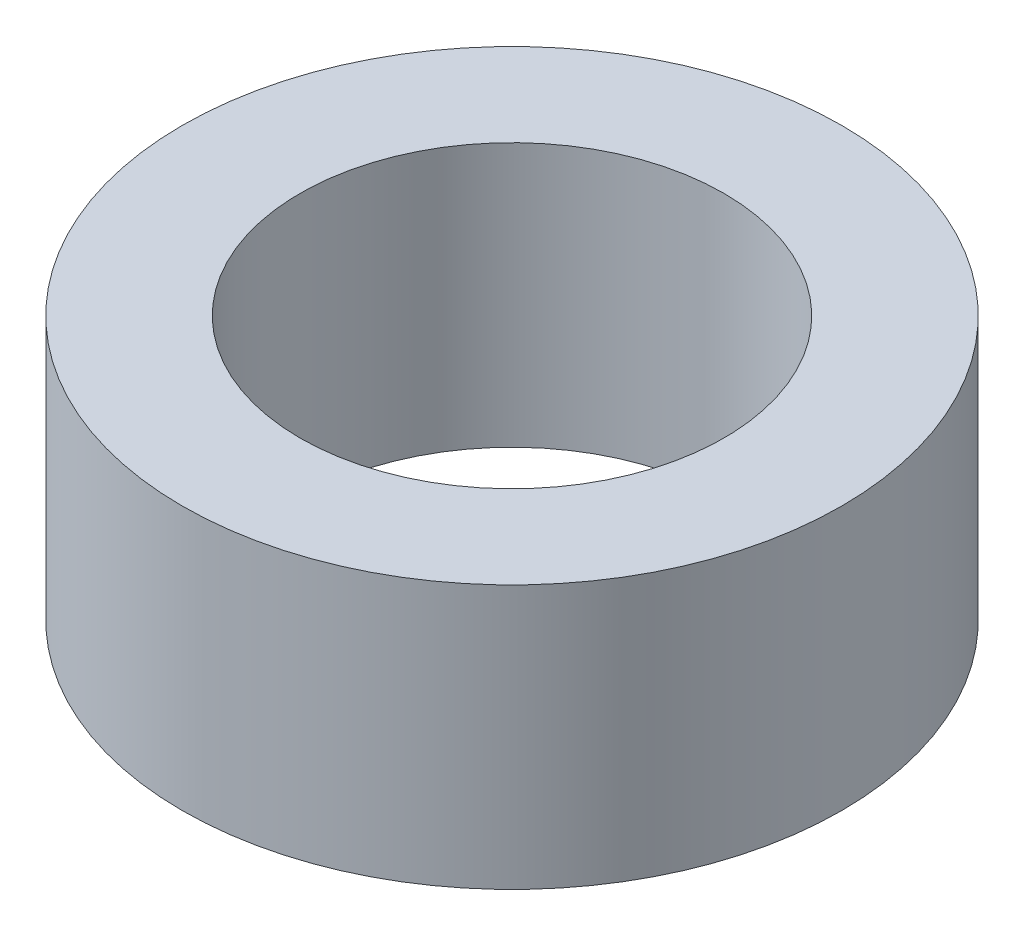
ISO-10303-21;
HEADER;
FILE_DESCRIPTION(('STEP AP214'),'2;1');
FILE_NAME('part.step','',(''),(''),'','','');
FILE_SCHEMA(('AUTOMOTIVE_DESIGN { 1 0 10303 214 1 1 1 1 }'));
ENDSEC;
DATA;
#1=APPLICATION_CONTEXT('core data for automotive mechanical design processes');
#2=APPLICATION_PROTOCOL_DEFINITION('international standard','automotive_design',2000,#1);
#3=PRODUCT_CONTEXT('',#1,'mechanical');
#4=PRODUCT('Part','Part','',(#3));
#5=PRODUCT_RELATED_PRODUCT_CATEGORY('part','',(#4));
#6=PRODUCT_DEFINITION_FORMATION('','',#4);
#7=PRODUCT_DEFINITION_CONTEXT('part definition',#1,'design');
#8=PRODUCT_DEFINITION('design','',#6,#7);
#9=PRODUCT_DEFINITION_SHAPE('','',#8);
#10=(LENGTH_UNIT() NAMED_UNIT(*) SI_UNIT(.MILLI.,.METRE.));
#11=(NAMED_UNIT(*) PLANE_ANGLE_UNIT() SI_UNIT($,.RADIAN.));
#12=(NAMED_UNIT(*) SI_UNIT($,.STERADIAN.) SOLID_ANGLE_UNIT());
#13=UNCERTAINTY_MEASURE_WITH_UNIT(LENGTH_MEASURE(1.E-05),#10,'distance_accuracy_value','');
#14=(GEOMETRIC_REPRESENTATION_CONTEXT(3) GLOBAL_UNCERTAINTY_ASSIGNED_CONTEXT((#13)) GLOBAL_UNIT_ASSIGNED_CONTEXT((#10,
#11,#12)) REPRESENTATION_CONTEXT('',''));
#15=CARTESIAN_POINT('',(0.,0.,0.));
#16=DIRECTION('',(0.,0.,1.));
#17=DIRECTION('',(1.,0.,0.));
#18=AXIS2_PLACEMENT_3D('',#15,#16,#17);
#19=CARTESIAN_POINT('',(0.,28.,0.));
#20=DIRECTION('',(0.,-1.,0.));
#21=DIRECTION('',(0.,0.,-1.));
#22=AXIS2_PLACEMENT_3D('',#19,#20,#21);
#23=CYLINDRICAL_SURFACE('',#22,35.);
#24=CARTESIAN_POINT('',(0.,28.,0.));
#25=DIRECTION('',(0.,1.,0.));
#26=DIRECTION('',(0.,0.,1.));
#27=AXIS2_PLACEMENT_3D('',#24,#25,#26);
#28=CIRCLE('',#27,35.);
#29=CARTESIAN_POINT('',(0.,28.,35.));
#30=VERTEX_POINT('',#29);
#31=EDGE_CURVE('E10',#30,#30,#28,.T.);
#32=ORIENTED_EDGE('',*,*,#31,.F.);
#33=EDGE_LOOP('',(#32));
#34=FACE_BOUND('',#33,.T.);
#35=CARTESIAN_POINT('',(0.,0.,0.));
#36=DIRECTION('',(0.,1.,0.));
#37=DIRECTION('',(0.,0.,1.));
#38=AXIS2_PLACEMENT_3D('',#35,#36,#37);
#39=CIRCLE('',#38,35.);
#40=CARTESIAN_POINT('',(0.,0.,35.));
#41=VERTEX_POINT('',#40);
#42=EDGE_CURVE('E37',#41,#41,#39,.T.);
#43=ORIENTED_EDGE('',*,*,#42,.T.);
#44=EDGE_LOOP('',(#43));
#45=FACE_BOUND('',#44,.T.);
#46=ADVANCED_FACE('F40',(#34,#45),#23,.T.);
#47=CARTESIAN_POINT('',(0.,28.,0.));
#48=DIRECTION('',(0.,1.,0.));
#49=DIRECTION('',(0.,0.,1.));
#50=AXIS2_PLACEMENT_3D('',#47,#48,#49);
#51=PLANE('',#50);
#52=CARTESIAN_POINT('',(0.,28.,0.));
#53=DIRECTION('',(0.,1.,0.));
#54=DIRECTION('',(0.,0.,1.));
#55=AXIS2_PLACEMENT_3D('',#52,#53,#54);
#56=CIRCLE('',#55,22.5);
#57=CARTESIAN_POINT('',(0.,28.,22.5));
#58=VERTEX_POINT('',#57);
#59=EDGE_CURVE('E50',#58,#58,#56,.T.);
#60=ORIENTED_EDGE('',*,*,#59,.F.);
#61=EDGE_LOOP('',(#60));
#62=FACE_BOUND('',#61,.T.);
#63=ORIENTED_EDGE('',*,*,#31,.T.);
#64=EDGE_LOOP('',(#63));
#65=FACE_BOUND('',#64,.T.);
#66=ADVANCED_FACE('F59',(#62,#65),#51,.T.);
#67=CARTESIAN_POINT('',(0.,0.,0.));
#68=DIRECTION('',(0.,1.,0.));
#69=DIRECTION('',(0.,0.,1.));
#70=AXIS2_PLACEMENT_3D('',#67,#68,#69);
#71=PLANE('',#70);
#72=CARTESIAN_POINT('',(0.,0.,0.));
#73=DIRECTION('',(0.,1.,0.));
#74=DIRECTION('',(0.,0.,1.));
#75=AXIS2_PLACEMENT_3D('',#72,#73,#74);
#76=CIRCLE('',#75,22.5);
#77=CARTESIAN_POINT('',(0.,0.,22.5));
#78=VERTEX_POINT('',#77);
#79=EDGE_CURVE('E47',#78,#78,#76,.T.);
#80=ORIENTED_EDGE('',*,*,#79,.T.);
#81=EDGE_LOOP('',(#80));
#82=FACE_BOUND('',#81,.T.);
#83=ORIENTED_EDGE('',*,*,#42,.F.);
#84=EDGE_LOOP('',(#83));
#85=FACE_BOUND('',#84,.T.);
#86=ADVANCED_FACE('F58',(#82,#85),#71,.F.);
#87=CARTESIAN_POINT('',(0.,28.,0.));
#88=DIRECTION('',(0.,-1.,0.));
#89=DIRECTION('',(0.,0.,-1.));
#90=AXIS2_PLACEMENT_3D('',#87,#88,#89);
#91=CYLINDRICAL_SURFACE('',#90,22.5);
#92=ORIENTED_EDGE('',*,*,#59,.T.);
#93=EDGE_LOOP('',(#92));
#94=FACE_BOUND('',#93,.T.);
#95=ORIENTED_EDGE('',*,*,#79,.F.);
#96=EDGE_LOOP('',(#95));
#97=FACE_BOUND('',#96,.T.);
#98=ADVANCED_FACE('F54',(#94,#97),#91,.F.);
#99=CLOSED_SHELL('',(#46,#66,#86,#98));
#100=MANIFOLD_SOLID_BREP('B2',#99);
#101=ADVANCED_BREP_SHAPE_REPRESENTATION('',(#18,#100),#14);
#102=SHAPE_DEFINITION_REPRESENTATION(#9,#101);
ENDSEC;
END-ISO-10303-21;
